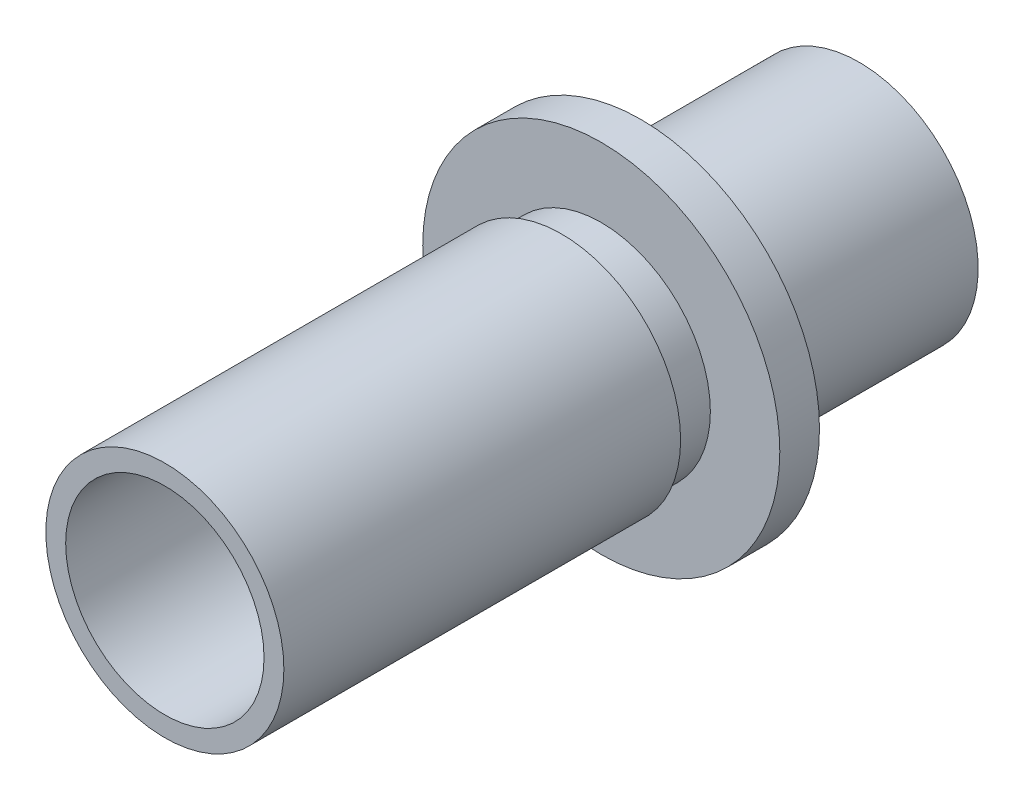
ISO-10303-21;
HEADER;
FILE_DESCRIPTION(('STEP AP214'),'2;1');
FILE_NAME('part.step','',(''),(''),'','','');
FILE_SCHEMA(('AUTOMOTIVE_DESIGN { 1 0 10303 214 1 1 1 1 }'));
ENDSEC;
DATA;
#1=APPLICATION_CONTEXT('core data for automotive mechanical design processes');
#2=APPLICATION_PROTOCOL_DEFINITION('international standard','automotive_design',2000,#1);
#3=PRODUCT_CONTEXT('',#1,'mechanical');
#4=PRODUCT('Part','Part','',(#3));
#5=PRODUCT_RELATED_PRODUCT_CATEGORY('part','',(#4));
#6=PRODUCT_DEFINITION_FORMATION('','',#4);
#7=PRODUCT_DEFINITION_CONTEXT('part definition',#1,'design');
#8=PRODUCT_DEFINITION('design','',#6,#7);
#9=PRODUCT_DEFINITION_SHAPE('','',#8);
#10=(LENGTH_UNIT() NAMED_UNIT(*) SI_UNIT(.MILLI.,.METRE.));
#11=(NAMED_UNIT(*) PLANE_ANGLE_UNIT() SI_UNIT($,.RADIAN.));
#12=(NAMED_UNIT(*) SI_UNIT($,.STERADIAN.) SOLID_ANGLE_UNIT());
#13=UNCERTAINTY_MEASURE_WITH_UNIT(LENGTH_MEASURE(1.E-05),#10,'distance_accuracy_value','');
#14=(GEOMETRIC_REPRESENTATION_CONTEXT(3) GLOBAL_UNCERTAINTY_ASSIGNED_CONTEXT((#13)) GLOBAL_UNIT_ASSIGNED_CONTEXT((#10,
#11,#12)) REPRESENTATION_CONTEXT('',''));
#15=CARTESIAN_POINT('',(0.,0.,0.));
#16=DIRECTION('',(0.,0.,1.));
#17=DIRECTION('',(1.,0.,0.));
#18=AXIS2_PLACEMENT_3D('',#15,#16,#17);
#19=CARTESIAN_POINT('',(0.,0.,12.));
#20=DIRECTION('',(0.,0.,1.));
#21=DIRECTION('',(1.,0.,0.));
#22=AXIS2_PLACEMENT_3D('',#19,#20,#21);
#23=PLANE('',#22);
#24=CARTESIAN_POINT('',(0.,0.,12.));
#25=DIRECTION('',(0.,0.,1.));
#26=DIRECTION('',(1.,0.,0.));
#27=AXIS2_PLACEMENT_3D('',#24,#25,#26);
#28=CIRCLE('',#27,9.);
#29=CARTESIAN_POINT('',(9.,0.,12.));
#30=VERTEX_POINT('',#29);
#31=EDGE_CURVE('E52',#30,#30,#28,.T.);
#32=ORIENTED_EDGE('',*,*,#31,.T.);
#33=EDGE_LOOP('',(#32));
#34=FACE_BOUND('',#33,.T.);
#35=CARTESIAN_POINT('',(0.,0.,12.));
#36=DIRECTION('',(0.,0.,1.));
#37=DIRECTION('',(1.,0.,0.));
#38=AXIS2_PLACEMENT_3D('',#35,#36,#37);
#39=CIRCLE('',#38,5.5);
#40=CARTESIAN_POINT('',(5.5,0.,12.));
#41=VERTEX_POINT('',#40);
#42=EDGE_CURVE('E61',#41,#41,#39,.T.);
#43=ORIENTED_EDGE('',*,*,#42,.F.);
#44=EDGE_LOOP('',(#43));
#45=FACE_BOUND('',#44,.T.);
#46=ADVANCED_FACE('F31',(#34,#45),#23,.T.);
#47=CARTESIAN_POINT('',(0.,0.,10.));
#48=DIRECTION('',(0.,0.,-1.));
#49=DIRECTION('',(-1.,0.,0.));
#50=AXIS2_PLACEMENT_3D('',#47,#48,#49);
#51=CYLINDRICAL_SURFACE('',#50,6.);
#52=CARTESIAN_POINT('',(0.,0.,10.));
#53=DIRECTION('',(0.,0.,1.));
#54=DIRECTION('',(1.,0.,0.));
#55=AXIS2_PLACEMENT_3D('',#52,#53,#54);
#56=CIRCLE('',#55,6.);
#57=CARTESIAN_POINT('',(6.,0.,10.));
#58=VERTEX_POINT('',#57);
#59=EDGE_CURVE('E10',#58,#58,#56,.T.);
#60=ORIENTED_EDGE('',*,*,#59,.F.);
#61=EDGE_LOOP('',(#60));
#62=FACE_BOUND('',#61,.T.);
#63=CARTESIAN_POINT('',(0.,0.,-1.));
#64=DIRECTION('',(0.,0.,-1.));
#65=DIRECTION('',(-1.,0.,0.));
#66=AXIS2_PLACEMENT_3D('',#63,#64,#65);
#67=CIRCLE('',#66,6.);
#68=CARTESIAN_POINT('',(-6.,0.,-1.));
#69=VERTEX_POINT('',#68);
#70=EDGE_CURVE('E42',#69,#69,#67,.T.);
#71=ORIENTED_EDGE('',*,*,#70,.F.);
#72=EDGE_LOOP('',(#71));
#73=FACE_BOUND('',#72,.T.);
#74=ADVANCED_FACE('F33',(#62,#73),#51,.T.);
#75=CARTESIAN_POINT('',(0.,0.,10.));
#76=DIRECTION('',(0.,0.,-1.));
#77=DIRECTION('',(-1.,0.,0.));
#78=AXIS2_PLACEMENT_3D('',#75,#76,#77);
#79=CYLINDRICAL_SURFACE('',#78,5.);
#80=CARTESIAN_POINT('',(0.,0.,0.));
#81=DIRECTION('',(0.,0.,1.));
#82=DIRECTION('',(1.,0.,0.));
#83=AXIS2_PLACEMENT_3D('',#80,#81,#82);
#84=CIRCLE('',#83,5.);
#85=CARTESIAN_POINT('',(5.,0.,0.));
#86=VERTEX_POINT('',#85);
#87=EDGE_CURVE('E38',#86,#86,#84,.T.);
#88=ORIENTED_EDGE('',*,*,#87,.F.);
#89=EDGE_LOOP('',(#88));
#90=FACE_BOUND('',#89,.T.);
#91=CARTESIAN_POINT('',(0.,0.,34.));
#92=DIRECTION('',(0.,0.,1.));
#93=DIRECTION('',(1.,0.,0.));
#94=AXIS2_PLACEMENT_3D('',#91,#92,#93);
#95=CIRCLE('',#94,5.);
#96=CARTESIAN_POINT('',(5.,0.,34.));
#97=VERTEX_POINT('',#96);
#98=EDGE_CURVE('E72',#97,#97,#95,.T.);
#99=ORIENTED_EDGE('',*,*,#98,.T.);
#100=EDGE_LOOP('',(#99));
#101=FACE_BOUND('',#100,.T.);
#102=ADVANCED_FACE('F76',(#90,#101),#79,.F.);
#103=CARTESIAN_POINT('',(0.,0.,0.));
#104=DIRECTION('',(0.,0.,-1.));
#105=DIRECTION('',(-1.,0.,0.));
#106=AXIS2_PLACEMENT_3D('',#103,#104,#105);
#107=PLANE('',#106);
#108=CARTESIAN_POINT('',(0.,0.,0.));
#109=DIRECTION('',(0.,0.,-1.));
#110=DIRECTION('',(-1.,0.,0.));
#111=AXIS2_PLACEMENT_3D('',#108,#109,#110);
#112=CIRCLE('',#111,4.5);
#113=CARTESIAN_POINT('',(-4.5,0.,0.));
#114=VERTEX_POINT('',#113);
#115=EDGE_CURVE('E49',#114,#114,#112,.T.);
#116=ORIENTED_EDGE('',*,*,#115,.T.);
#117=EDGE_LOOP('',(#116));
#118=FACE_BOUND('',#117,.T.);
#119=ORIENTED_EDGE('',*,*,#87,.T.);
#120=EDGE_LOOP('',(#119));
#121=FACE_BOUND('',#120,.T.);
#122=ADVANCED_FACE('F115',(#118,#121),#107,.F.);
#123=CARTESIAN_POINT('',(0.,0.,-1.));
#124=DIRECTION('',(0.,0.,-1.));
#125=DIRECTION('',(-1.,0.,0.));
#126=AXIS2_PLACEMENT_3D('',#123,#124,#125);
#127=PLANE('',#126);
#128=ORIENTED_EDGE('',*,*,#70,.T.);
#129=EDGE_LOOP('',(#128));
#130=FACE_BOUND('',#129,.T.);
#131=CARTESIAN_POINT('',(0.,0.,-1.));
#132=DIRECTION('',(0.,0.,-1.));
#133=DIRECTION('',(-1.,0.,0.));
#134=AXIS2_PLACEMENT_3D('',#131,#132,#133);
#135=CIRCLE('',#134,4.5);
#136=CARTESIAN_POINT('',(-4.5,0.,-1.));
#137=VERTEX_POINT('',#136);
#138=EDGE_CURVE('E46',#137,#137,#135,.T.);
#139=ORIENTED_EDGE('',*,*,#138,.F.);
#140=EDGE_LOOP('',(#139));
#141=FACE_BOUND('',#140,.T.);
#142=ADVANCED_FACE('F111',(#130,#141),#127,.T.);
#143=CARTESIAN_POINT('',(0.,0.,-1.));
#144=DIRECTION('',(0.,0.,1.));
#145=DIRECTION('',(1.,0.,0.));
#146=AXIS2_PLACEMENT_3D('',#143,#144,#145);
#147=CYLINDRICAL_SURFACE('',#146,4.5);
#148=ORIENTED_EDGE('',*,*,#138,.T.);
#149=EDGE_LOOP('',(#148));
#150=FACE_BOUND('',#149,.T.);
#151=ORIENTED_EDGE('',*,*,#115,.F.);
#152=EDGE_LOOP('',(#151));
#153=FACE_BOUND('',#152,.T.);
#154=ADVANCED_FACE('F105',(#150,#153),#147,.F.);
#155=CARTESIAN_POINT('',(0.,0.,10.));
#156=DIRECTION('',(0.,0.,1.));
#157=DIRECTION('',(1.,0.,0.));
#158=AXIS2_PLACEMENT_3D('',#155,#156,#157);
#159=PLANE('',#158);
#160=ORIENTED_EDGE('',*,*,#59,.T.);
#161=EDGE_LOOP('',(#160));
#162=FACE_BOUND('',#161,.T.);
#163=CARTESIAN_POINT('',(0.,0.,10.));
#164=DIRECTION('',(0.,0.,1.));
#165=DIRECTION('',(1.,0.,0.));
#166=AXIS2_PLACEMENT_3D('',#163,#164,#165);
#167=CIRCLE('',#166,9.);
#168=CARTESIAN_POINT('',(9.,0.,10.));
#169=VERTEX_POINT('',#168);
#170=EDGE_CURVE('E55',#169,#169,#167,.T.);
#171=ORIENTED_EDGE('',*,*,#170,.F.);
#172=EDGE_LOOP('',(#171));
#173=FACE_BOUND('',#172,.T.);
#174=ADVANCED_FACE('F101',(#162,#173),#159,.F.);
#175=CARTESIAN_POINT('',(0.,0.,12.));
#176=DIRECTION('',(0.,0.,-1.));
#177=DIRECTION('',(-1.,0.,0.));
#178=AXIS2_PLACEMENT_3D('',#175,#176,#177);
#179=CYLINDRICAL_SURFACE('',#178,9.);
#180=ORIENTED_EDGE('',*,*,#31,.F.);
#181=EDGE_LOOP('',(#180));
#182=FACE_BOUND('',#181,.T.);
#183=ORIENTED_EDGE('',*,*,#170,.T.);
#184=EDGE_LOOP('',(#183));
#185=FACE_BOUND('',#184,.T.);
#186=ADVANCED_FACE('F104',(#182,#185),#179,.T.);
#187=CARTESIAN_POINT('',(0.,0.,14.));
#188=DIRECTION('',(0.,0.,-1.));
#189=DIRECTION('',(-1.,0.,0.));
#190=AXIS2_PLACEMENT_3D('',#187,#188,#189);
#191=CYLINDRICAL_SURFACE('',#190,5.5);
#192=CARTESIAN_POINT('',(0.,0.,14.));
#193=DIRECTION('',(0.,0.,1.));
#194=DIRECTION('',(1.,0.,0.));
#195=AXIS2_PLACEMENT_3D('',#192,#193,#194);
#196=CIRCLE('',#195,5.5);
#197=CARTESIAN_POINT('',(5.5,0.,14.));
#198=VERTEX_POINT('',#197);
#199=EDGE_CURVE('E58',#198,#198,#196,.T.);
#200=ORIENTED_EDGE('',*,*,#199,.F.);
#201=EDGE_LOOP('',(#200));
#202=FACE_BOUND('',#201,.T.);
#203=ORIENTED_EDGE('',*,*,#42,.T.);
#204=EDGE_LOOP('',(#203));
#205=FACE_BOUND('',#204,.T.);
#206=ADVANCED_FACE('F100',(#202,#205),#191,.T.);
#207=CARTESIAN_POINT('',(0.,0.,14.));
#208=DIRECTION('',(0.,0.,1.));
#209=DIRECTION('',(1.,0.,0.));
#210=AXIS2_PLACEMENT_3D('',#207,#208,#209);
#211=PLANE('',#210);
#212=ORIENTED_EDGE('',*,*,#199,.T.);
#213=EDGE_LOOP('',(#212));
#214=FACE_BOUND('',#213,.T.);
#215=CARTESIAN_POINT('',(0.,0.,14.));
#216=DIRECTION('',(0.,0.,1.));
#217=DIRECTION('',(1.,0.,0.));
#218=AXIS2_PLACEMENT_3D('',#215,#216,#217);
#219=CIRCLE('',#218,6.);
#220=CARTESIAN_POINT('',(6.,0.,14.));
#221=VERTEX_POINT('',#220);
#222=EDGE_CURVE('E64',#221,#221,#219,.T.);
#223=ORIENTED_EDGE('',*,*,#222,.F.);
#224=EDGE_LOOP('',(#223));
#225=FACE_BOUND('',#224,.T.);
#226=ADVANCED_FACE('F86',(#214,#225),#211,.F.);
#227=CARTESIAN_POINT('',(0.,0.,24.));
#228=DIRECTION('',(0.,0.,-1.));
#229=DIRECTION('',(-1.,0.,0.));
#230=AXIS2_PLACEMENT_3D('',#227,#228,#229);
#231=CYLINDRICAL_SURFACE('',#230,6.);
#232=ORIENTED_EDGE('',*,*,#222,.T.);
#233=EDGE_LOOP('',(#232));
#234=FACE_BOUND('',#233,.T.);
#235=CARTESIAN_POINT('',(0.,0.,34.));
#236=DIRECTION('',(0.,0.,1.));
#237=DIRECTION('',(1.,0.,0.));
#238=AXIS2_PLACEMENT_3D('',#235,#236,#237);
#239=CIRCLE('',#238,6.);
#240=CARTESIAN_POINT('',(6.,0.,34.));
#241=VERTEX_POINT('',#240);
#242=EDGE_CURVE('E69',#241,#241,#239,.T.);
#243=ORIENTED_EDGE('',*,*,#242,.F.);
#244=EDGE_LOOP('',(#243));
#245=FACE_BOUND('',#244,.T.);
#246=ADVANCED_FACE('F80',(#234,#245),#231,.T.);
#247=CARTESIAN_POINT('',(0.,0.,34.));
#248=DIRECTION('',(0.,0.,1.));
#249=DIRECTION('',(1.,0.,0.));
#250=AXIS2_PLACEMENT_3D('',#247,#248,#249);
#251=PLANE('',#250);
#252=ORIENTED_EDGE('',*,*,#242,.T.);
#253=EDGE_LOOP('',(#252));
#254=FACE_BOUND('',#253,.T.);
#255=ORIENTED_EDGE('',*,*,#98,.F.);
#256=EDGE_LOOP('',(#255));
#257=FACE_BOUND('',#256,.T.);
#258=ADVANCED_FACE('F78',(#254,#257),#251,.T.);
#259=CLOSED_SHELL('',(#46,#74,#102,#122,#142,#154,#174,#186,#206,#226,#246,#258));
#260=MANIFOLD_SOLID_BREP('B2',#259);
#261=ADVANCED_BREP_SHAPE_REPRESENTATION('',(#18,#260),#14);
#262=SHAPE_DEFINITION_REPRESENTATION(#9,#261);
ENDSEC;
END-ISO-10303-21;
